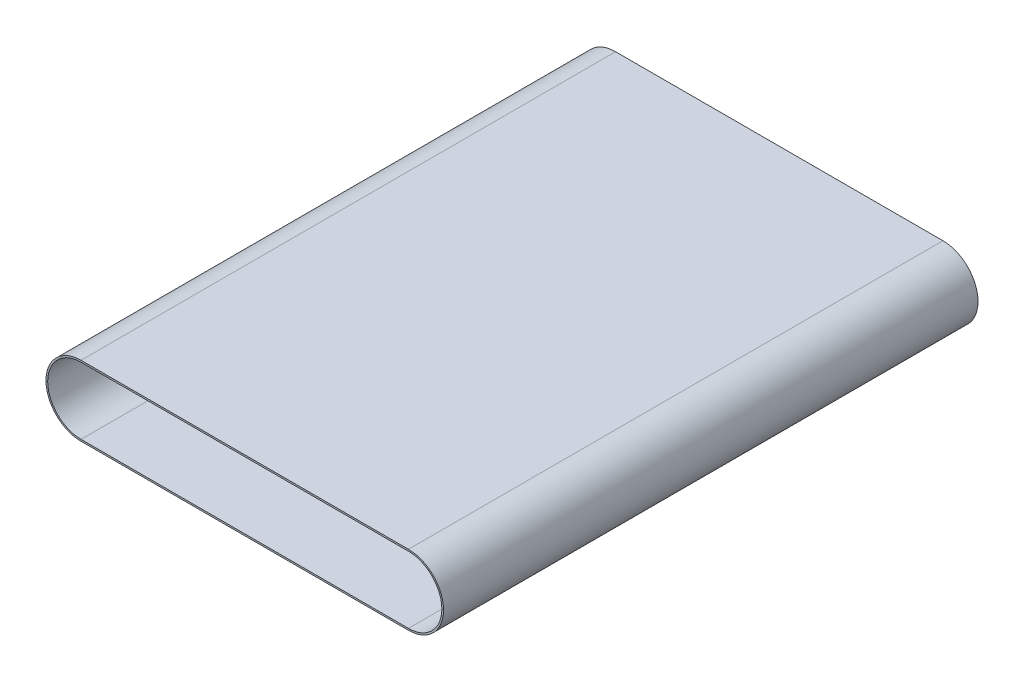
ISO-10303-21;
HEADER;
FILE_DESCRIPTION(('STEP AP214'),'2;1');
FILE_NAME('part.step','',(''),(''),'','','');
FILE_SCHEMA(('AUTOMOTIVE_DESIGN { 1 0 10303 214 1 1 1 1 }'));
ENDSEC;
DATA;
#1=APPLICATION_CONTEXT('core data for automotive mechanical design processes');
#2=APPLICATION_PROTOCOL_DEFINITION('international standard','automotive_design',2000,#1);
#3=PRODUCT_CONTEXT('',#1,'mechanical');
#4=PRODUCT('Part','Part','',(#3));
#5=PRODUCT_RELATED_PRODUCT_CATEGORY('part','',(#4));
#6=PRODUCT_DEFINITION_FORMATION('','',#4);
#7=PRODUCT_DEFINITION_CONTEXT('part definition',#1,'design');
#8=PRODUCT_DEFINITION('design','',#6,#7);
#9=PRODUCT_DEFINITION_SHAPE('','',#8);
#10=(LENGTH_UNIT() NAMED_UNIT(*) SI_UNIT(.MILLI.,.METRE.));
#11=(NAMED_UNIT(*) PLANE_ANGLE_UNIT() SI_UNIT($,.RADIAN.));
#12=(NAMED_UNIT(*) SI_UNIT($,.STERADIAN.) SOLID_ANGLE_UNIT());
#13=UNCERTAINTY_MEASURE_WITH_UNIT(LENGTH_MEASURE(1.E-05),#10,'distance_accuracy_value','');
#14=(GEOMETRIC_REPRESENTATION_CONTEXT(3) GLOBAL_UNCERTAINTY_ASSIGNED_CONTEXT((#13)) GLOBAL_UNIT_ASSIGNED_CONTEXT((#10,
#11,#12)) REPRESENTATION_CONTEXT('',''));
#15=CARTESIAN_POINT('',(0.,0.,0.));
#16=DIRECTION('',(0.,0.,1.));
#17=DIRECTION('',(1.,0.,0.));
#18=AXIS2_PLACEMENT_3D('',#15,#16,#17);
#19=CARTESIAN_POINT('',(-122.5,0.,400.));
#20=DIRECTION('',(0.,0.,1.));
#21=DIRECTION('',(1.,0.,0.));
#22=AXIS2_PLACEMENT_3D('',#19,#20,#21);
#23=PLANE('',#22);
#24=CARTESIAN_POINT('',(-122.5,0.,400.));
#25=DIRECTION('',(0.,0.,1.));
#26=DIRECTION('',(1.,0.,0.));
#27=AXIS2_PLACEMENT_3D('',#24,#25,#26);
#28=CIRCLE('',#27,26.25);
#29=CARTESIAN_POINT('',(-122.5,26.25,400.));
#30=VERTEX_POINT('',#29);
#31=CARTESIAN_POINT('',(-122.5,-26.25,400.));
#32=VERTEX_POINT('',#31);
#33=EDGE_CURVE('E134',#30,#32,#28,.T.);
#34=ORIENTED_EDGE('',*,*,#33,.T.);
#35=DIRECTION('',(1.,0.,0.));
#36=VECTOR('',#35,1.);
#37=CARTESIAN_POINT('',(122.5,-26.2499999999999,400.));
#38=LINE('',#37,#36);
#39=CARTESIAN_POINT('',(122.5,-26.2499999999999,400.));
#40=VERTEX_POINT('',#39);
#41=EDGE_CURVE('E137',#32,#40,#38,.T.);
#42=ORIENTED_EDGE('',*,*,#41,.T.);
#43=CARTESIAN_POINT('',(122.5,0.,400.));
#44=DIRECTION('',(0.,0.,1.));
#45=DIRECTION('',(1.,0.,0.));
#46=AXIS2_PLACEMENT_3D('',#43,#44,#45);
#47=CIRCLE('',#46,26.25);
#48=CARTESIAN_POINT('',(122.5,26.25,400.));
#49=VERTEX_POINT('',#48);
#50=EDGE_CURVE('E140',#40,#49,#47,.T.);
#51=ORIENTED_EDGE('',*,*,#50,.T.);
#52=DIRECTION('',(-1.,0.,0.));
#53=VECTOR('',#52,1.);
#54=CARTESIAN_POINT('',(-122.5,26.25,400.));
#55=LINE('',#54,#53);
#56=EDGE_CURVE('E142',#49,#30,#55,.T.);
#57=ORIENTED_EDGE('',*,*,#56,.T.);
#58=EDGE_LOOP('',(#34,#42,#51,#57));
#59=FACE_BOUND('',#58,.T.);
#60=DIRECTION('',(1.,0.,0.));
#61=VECTOR('',#60,1.);
#62=CARTESIAN_POINT('',(-122.5,-25.,400.));
#63=LINE('',#62,#61);
#64=CARTESIAN_POINT('',(-122.5,-25.,400.));
#65=VERTEX_POINT('',#64);
#66=CARTESIAN_POINT('',(122.5,-25.,400.));
#67=VERTEX_POINT('',#66);
#68=EDGE_CURVE('E106',#65,#67,#63,.T.);
#69=ORIENTED_EDGE('',*,*,#68,.F.);
#70=CARTESIAN_POINT('',(-122.5,0.,400.));
#71=DIRECTION('',(0.,0.,1.));
#72=DIRECTION('',(1.,0.,0.));
#73=AXIS2_PLACEMENT_3D('',#70,#71,#72);
#74=CIRCLE('',#73,25.);
#75=CARTESIAN_POINT('',(-122.5,25.,400.));
#76=VERTEX_POINT('',#75);
#77=EDGE_CURVE('E98',#76,#65,#74,.T.);
#78=ORIENTED_EDGE('',*,*,#77,.F.);
#79=DIRECTION('',(-1.,0.,0.));
#80=VECTOR('',#79,1.);
#81=CARTESIAN_POINT('',(-122.5,25.,400.));
#82=LINE('',#81,#80);
#83=CARTESIAN_POINT('',(122.5,25.0000000000001,400.));
#84=VERTEX_POINT('',#83);
#85=EDGE_CURVE('E120',#84,#76,#82,.T.);
#86=ORIENTED_EDGE('',*,*,#85,.F.);
#87=CARTESIAN_POINT('',(122.5,0.,400.));
#88=DIRECTION('',(0.,0.,1.));
#89=DIRECTION('',(1.,0.,0.));
#90=AXIS2_PLACEMENT_3D('',#87,#88,#89);
#91=CIRCLE('',#90,25.);
#92=EDGE_CURVE('E118',#67,#84,#91,.T.);
#93=ORIENTED_EDGE('',*,*,#92,.F.);
#94=EDGE_LOOP('',(#69,#78,#86,#93));
#95=FACE_BOUND('',#94,.T.);
#96=ADVANCED_FACE('F33',(#59,#95),#23,.T.);
#97=CARTESIAN_POINT('',(-122.5,0.,0.));
#98=DIRECTION('',(0.,0.,1.));
#99=DIRECTION('',(1.,0.,0.));
#100=AXIS2_PLACEMENT_3D('',#97,#98,#99);
#101=PLANE('',#100);
#102=CARTESIAN_POINT('',(-122.5,0.,0.));
#103=DIRECTION('',(0.,0.,1.));
#104=DIRECTION('',(1.,0.,0.));
#105=AXIS2_PLACEMENT_3D('',#102,#103,#104);
#106=CIRCLE('',#105,26.25);
#107=CARTESIAN_POINT('',(-122.5,26.25,0.));
#108=VERTEX_POINT('',#107);
#109=CARTESIAN_POINT('',(-122.5,-26.25,0.));
#110=VERTEX_POINT('',#109);
#111=EDGE_CURVE('E114',#108,#110,#106,.T.);
#112=ORIENTED_EDGE('',*,*,#111,.F.);
#113=DIRECTION('',(-1.,0.,0.));
#114=VECTOR('',#113,1.);
#115=CARTESIAN_POINT('',(-122.5,26.25,0.));
#116=LINE('',#115,#114);
#117=CARTESIAN_POINT('',(122.5,26.25,0.));
#118=VERTEX_POINT('',#117);
#119=EDGE_CURVE('E138',#118,#108,#116,.T.);
#120=ORIENTED_EDGE('',*,*,#119,.F.);
#121=CARTESIAN_POINT('',(122.5,0.,0.));
#122=DIRECTION('',(0.,0.,1.));
#123=DIRECTION('',(1.,0.,0.));
#124=AXIS2_PLACEMENT_3D('',#121,#122,#123);
#125=CIRCLE('',#124,26.25);
#126=CARTESIAN_POINT('',(122.5,-26.2499999999999,0.));
#127=VERTEX_POINT('',#126);
#128=EDGE_CURVE('E149',#127,#118,#125,.T.);
#129=ORIENTED_EDGE('',*,*,#128,.F.);
#130=DIRECTION('',(1.,0.,0.));
#131=VECTOR('',#130,1.);
#132=CARTESIAN_POINT('',(122.5,-26.2499999999999,0.));
#133=LINE('',#132,#131);
#134=EDGE_CURVE('E147',#110,#127,#133,.T.);
#135=ORIENTED_EDGE('',*,*,#134,.F.);
#136=EDGE_LOOP('',(#112,#120,#129,#135));
#137=FACE_BOUND('',#136,.T.);
#138=CARTESIAN_POINT('',(-122.5,0.,0.));
#139=DIRECTION('',(0.,0.,1.));
#140=DIRECTION('',(1.,0.,0.));
#141=AXIS2_PLACEMENT_3D('',#138,#139,#140);
#142=CIRCLE('',#141,25.);
#143=CARTESIAN_POINT('',(-122.5,25.,0.));
#144=VERTEX_POINT('',#143);
#145=CARTESIAN_POINT('',(-122.5,-25.,0.));
#146=VERTEX_POINT('',#145);
#147=EDGE_CURVE('E56',#144,#146,#142,.T.);
#148=ORIENTED_EDGE('',*,*,#147,.T.);
#149=DIRECTION('',(1.,0.,0.));
#150=VECTOR('',#149,1.);
#151=CARTESIAN_POINT('',(-122.5,-25.,0.));
#152=LINE('',#151,#150);
#153=CARTESIAN_POINT('',(122.5,-25.,0.));
#154=VERTEX_POINT('',#153);
#155=EDGE_CURVE('E113',#146,#154,#152,.T.);
#156=ORIENTED_EDGE('',*,*,#155,.T.);
#157=CARTESIAN_POINT('',(122.5,0.,0.));
#158=DIRECTION('',(0.,0.,1.));
#159=DIRECTION('',(1.,0.,0.));
#160=AXIS2_PLACEMENT_3D('',#157,#158,#159);
#161=CIRCLE('',#160,25.);
#162=CARTESIAN_POINT('',(122.5,25.0000000000001,0.));
#163=VERTEX_POINT('',#162);
#164=EDGE_CURVE('E126',#154,#163,#161,.T.);
#165=ORIENTED_EDGE('',*,*,#164,.T.);
#166=DIRECTION('',(-1.,0.,0.));
#167=VECTOR('',#166,1.);
#168=CARTESIAN_POINT('',(-122.5,25.,0.));
#169=LINE('',#168,#167);
#170=EDGE_CURVE('E107',#163,#144,#169,.T.);
#171=ORIENTED_EDGE('',*,*,#170,.T.);
#172=EDGE_LOOP('',(#148,#156,#165,#171));
#173=FACE_BOUND('',#172,.T.);
#174=ADVANCED_FACE('F167',(#137,#173),#101,.F.);
#175=CARTESIAN_POINT('',(-122.5,0.,400.));
#176=DIRECTION('',(0.,0.,-1.));
#177=DIRECTION('',(-1.,0.,0.));
#178=AXIS2_PLACEMENT_3D('',#175,#176,#177);
#179=CYLINDRICAL_SURFACE('',#178,26.25);
#180=ORIENTED_EDGE('',*,*,#111,.T.);
#181=DIRECTION('',(0.,0.,-1.));
#182=VECTOR('',#181,1.);
#183=CARTESIAN_POINT('',(-122.5,-26.25,400.));
#184=LINE('',#183,#182);
#185=EDGE_CURVE('E11',#32,#110,#184,.T.);
#186=ORIENTED_EDGE('',*,*,#185,.F.);
#187=ORIENTED_EDGE('',*,*,#33,.F.);
#188=DIRECTION('',(0.,0.,-1.));
#189=VECTOR('',#188,1.);
#190=CARTESIAN_POINT('',(-122.5,26.25,400.));
#191=LINE('',#190,#189);
#192=EDGE_CURVE('E144',#30,#108,#191,.T.);
#193=ORIENTED_EDGE('',*,*,#192,.T.);
#194=EDGE_LOOP('',(#180,#186,#187,#193));
#195=FACE_BOUND('',#194,.T.);
#196=ADVANCED_FACE('F35',(#195),#179,.T.);
#197=CARTESIAN_POINT('',(122.5,-26.2499999999999,400.));
#198=DIRECTION('',(0.,1.,0.));
#199=DIRECTION('',(-1.,0.,0.));
#200=AXIS2_PLACEMENT_3D('',#197,#198,#199);
#201=PLANE('',#200);
#202=ORIENTED_EDGE('',*,*,#134,.T.);
#203=DIRECTION('',(0.,0.,-1.));
#204=VECTOR('',#203,1.);
#205=CARTESIAN_POINT('',(122.5,-26.2499999999999,400.));
#206=LINE('',#205,#204);
#207=EDGE_CURVE('E41',#40,#127,#206,.T.);
#208=ORIENTED_EDGE('',*,*,#207,.F.);
#209=ORIENTED_EDGE('',*,*,#41,.F.);
#210=ORIENTED_EDGE('',*,*,#185,.T.);
#211=EDGE_LOOP('',(#202,#208,#209,#210));
#212=FACE_BOUND('',#211,.T.);
#213=ADVANCED_FACE('F177',(#212),#201,.F.);
#214=CARTESIAN_POINT('',(122.5,0.,400.));
#215=DIRECTION('',(0.,0.,-1.));
#216=DIRECTION('',(-1.,0.,0.));
#217=AXIS2_PLACEMENT_3D('',#214,#215,#216);
#218=CYLINDRICAL_SURFACE('',#217,26.25);
#219=ORIENTED_EDGE('',*,*,#128,.T.);
#220=DIRECTION('',(0.,0.,-1.));
#221=VECTOR('',#220,1.);
#222=CARTESIAN_POINT('',(122.5,26.25,400.));
#223=LINE('',#222,#221);
#224=EDGE_CURVE('E154',#49,#118,#223,.T.);
#225=ORIENTED_EDGE('',*,*,#224,.F.);
#226=ORIENTED_EDGE('',*,*,#50,.F.);
#227=ORIENTED_EDGE('',*,*,#207,.T.);
#228=EDGE_LOOP('',(#219,#225,#226,#227));
#229=FACE_BOUND('',#228,.T.);
#230=ADVANCED_FACE('F161',(#229),#218,.T.);
#231=CARTESIAN_POINT('',(-122.5,26.25,400.));
#232=DIRECTION('',(0.,-1.,0.));
#233=DIRECTION('',(1.,0.,0.));
#234=AXIS2_PLACEMENT_3D('',#231,#232,#233);
#235=PLANE('',#234);
#236=ORIENTED_EDGE('',*,*,#119,.T.);
#237=ORIENTED_EDGE('',*,*,#192,.F.);
#238=ORIENTED_EDGE('',*,*,#56,.F.);
#239=ORIENTED_EDGE('',*,*,#224,.T.);
#240=EDGE_LOOP('',(#236,#237,#238,#239));
#241=FACE_BOUND('',#240,.T.);
#242=ADVANCED_FACE('F171',(#241),#235,.F.);
#243=CARTESIAN_POINT('',(-122.5,0.,400.));
#244=DIRECTION('',(0.,0.,-1.));
#245=DIRECTION('',(-1.,0.,0.));
#246=AXIS2_PLACEMENT_3D('',#243,#244,#245);
#247=CYLINDRICAL_SURFACE('',#246,25.);
#248=ORIENTED_EDGE('',*,*,#147,.F.);
#249=DIRECTION('',(0.,0.,-1.));
#250=VECTOR('',#249,1.);
#251=CARTESIAN_POINT('',(-122.5,25.,400.));
#252=LINE('',#251,#250);
#253=EDGE_CURVE('E102',#76,#144,#252,.T.);
#254=ORIENTED_EDGE('',*,*,#253,.F.);
#255=ORIENTED_EDGE('',*,*,#77,.T.);
#256=DIRECTION('',(0.,0.,-1.));
#257=VECTOR('',#256,1.);
#258=CARTESIAN_POINT('',(-122.5,-25.,400.));
#259=LINE('',#258,#257);
#260=EDGE_CURVE('E101',#65,#146,#259,.T.);
#261=ORIENTED_EDGE('',*,*,#260,.T.);
#262=EDGE_LOOP('',(#248,#254,#255,#261));
#263=FACE_BOUND('',#262,.T.);
#264=ADVANCED_FACE('F100',(#263),#247,.F.);
#265=CARTESIAN_POINT('',(-122.5,-25.,400.));
#266=DIRECTION('',(0.,1.,0.));
#267=DIRECTION('',(-1.,0.,0.));
#268=AXIS2_PLACEMENT_3D('',#265,#266,#267);
#269=PLANE('',#268);
#270=ORIENTED_EDGE('',*,*,#155,.F.);
#271=ORIENTED_EDGE('',*,*,#260,.F.);
#272=ORIENTED_EDGE('',*,*,#68,.T.);
#273=DIRECTION('',(0.,0.,-1.));
#274=VECTOR('',#273,1.);
#275=CARTESIAN_POINT('',(122.5,-25.,400.));
#276=LINE('',#275,#274);
#277=EDGE_CURVE('E115',#67,#154,#276,.T.);
#278=ORIENTED_EDGE('',*,*,#277,.T.);
#279=EDGE_LOOP('',(#270,#271,#272,#278));
#280=FACE_BOUND('',#279,.T.);
#281=ADVANCED_FACE('F110',(#280),#269,.T.);
#282=CARTESIAN_POINT('',(122.5,0.,400.));
#283=DIRECTION('',(0.,0.,-1.));
#284=DIRECTION('',(-1.,0.,0.));
#285=AXIS2_PLACEMENT_3D('',#282,#283,#284);
#286=CYLINDRICAL_SURFACE('',#285,25.);
#287=ORIENTED_EDGE('',*,*,#164,.F.);
#288=ORIENTED_EDGE('',*,*,#277,.F.);
#289=ORIENTED_EDGE('',*,*,#92,.T.);
#290=DIRECTION('',(0.,0.,-1.));
#291=VECTOR('',#290,1.);
#292=CARTESIAN_POINT('',(122.5,25.0000000000001,400.));
#293=LINE('',#292,#291);
#294=EDGE_CURVE('E48',#84,#163,#293,.T.);
#295=ORIENTED_EDGE('',*,*,#294,.T.);
#296=EDGE_LOOP('',(#287,#288,#289,#295));
#297=FACE_BOUND('',#296,.T.);
#298=ADVANCED_FACE('F200',(#297),#286,.F.);
#299=CARTESIAN_POINT('',(-122.5,25.,400.));
#300=DIRECTION('',(0.,-1.,0.));
#301=DIRECTION('',(1.,0.,0.));
#302=AXIS2_PLACEMENT_3D('',#299,#300,#301);
#303=PLANE('',#302);
#304=ORIENTED_EDGE('',*,*,#170,.F.);
#305=ORIENTED_EDGE('',*,*,#294,.F.);
#306=ORIENTED_EDGE('',*,*,#85,.T.);
#307=ORIENTED_EDGE('',*,*,#253,.T.);
#308=EDGE_LOOP('',(#304,#305,#306,#307));
#309=FACE_BOUND('',#308,.T.);
#310=ADVANCED_FACE('F204',(#309),#303,.T.);
#311=CLOSED_SHELL('',(#96,#174,#196,#213,#230,#242,#264,#281,#298,#310));
#312=MANIFOLD_SOLID_BREP('B2',#311);
#313=ADVANCED_BREP_SHAPE_REPRESENTATION('',(#18,#312),#14);
#314=SHAPE_DEFINITION_REPRESENTATION(#9,#313);
ENDSEC;
END-ISO-10303-21;
